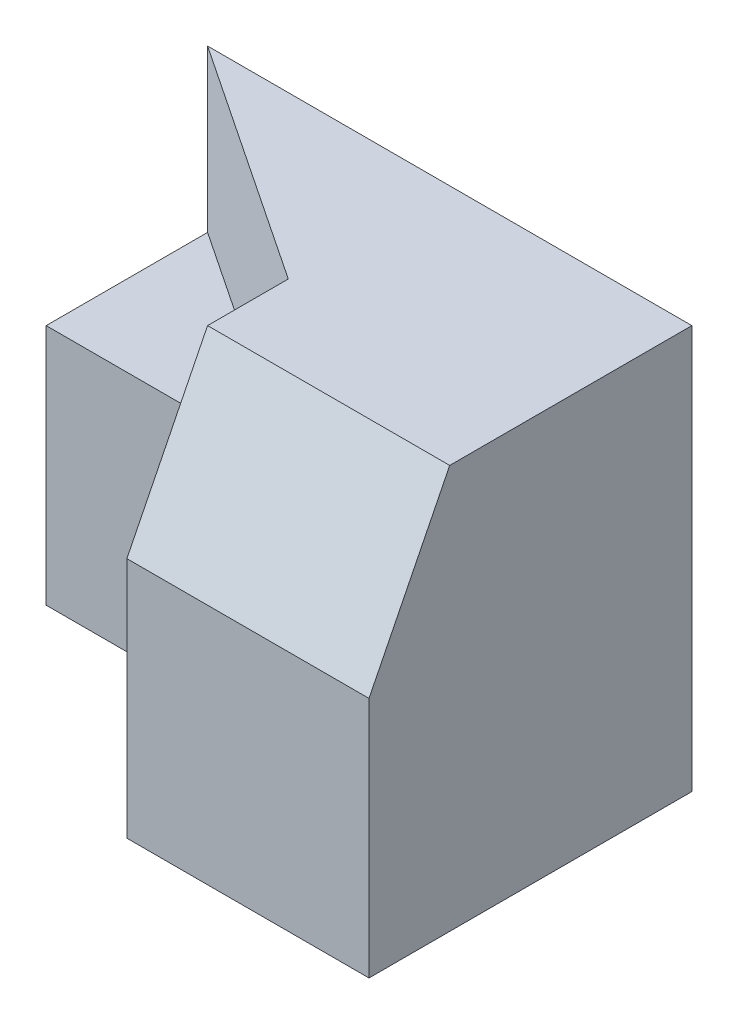
ISO-10303-21;
HEADER;
FILE_DESCRIPTION(('STEP AP214'),'2;1');
FILE_NAME('part.step','',(''),(''),'','','');
FILE_SCHEMA(('AUTOMOTIVE_DESIGN { 1 0 10303 214 1 1 1 1 }'));
ENDSEC;
DATA;
#1=APPLICATION_CONTEXT('core data for automotive mechanical design processes');
#2=APPLICATION_PROTOCOL_DEFINITION('international standard','automotive_design',2000,#1);
#3=PRODUCT_CONTEXT('',#1,'mechanical');
#4=PRODUCT('Part','Part','',(#3));
#5=PRODUCT_RELATED_PRODUCT_CATEGORY('part','',(#4));
#6=PRODUCT_DEFINITION_FORMATION('','',#4);
#7=PRODUCT_DEFINITION_CONTEXT('part definition',#1,'design');
#8=PRODUCT_DEFINITION('design','',#6,#7);
#9=PRODUCT_DEFINITION_SHAPE('','',#8);
#10=(LENGTH_UNIT() NAMED_UNIT(*) SI_UNIT(.MILLI.,.METRE.));
#11=(NAMED_UNIT(*) PLANE_ANGLE_UNIT() SI_UNIT($,.RADIAN.));
#12=(NAMED_UNIT(*) SI_UNIT($,.STERADIAN.) SOLID_ANGLE_UNIT());
#13=UNCERTAINTY_MEASURE_WITH_UNIT(LENGTH_MEASURE(1.E-05),#10,'distance_accuracy_value','');
#14=(GEOMETRIC_REPRESENTATION_CONTEXT(3) GLOBAL_UNCERTAINTY_ASSIGNED_CONTEXT((#13)) GLOBAL_UNIT_ASSIGNED_CONTEXT((#10,
#11,#12)) REPRESENTATION_CONTEXT('',''));
#15=CARTESIAN_POINT('',(0.,0.,0.));
#16=DIRECTION('',(0.,0.,1.));
#17=DIRECTION('',(1.,0.,0.));
#18=AXIS2_PLACEMENT_3D('',#15,#16,#17);
#19=CARTESIAN_POINT('',(0.,0.,20.));
#20=DIRECTION('',(1.,0.,0.));
#21=DIRECTION('',(0.,0.,-1.));
#22=AXIS2_PLACEMENT_3D('',#19,#20,#21);
#23=PLANE('',#22);
#24=DIRECTION('',(0.,-1.,0.));
#25=VECTOR('',#24,1.);
#26=CARTESIAN_POINT('',(0.,0.,10.));
#27=LINE('',#26,#25);
#28=CARTESIAN_POINT('',(0.,15.,10.));
#29=VERTEX_POINT('',#28);
#30=CARTESIAN_POINT('',(0.,0.,10.));
#31=VERTEX_POINT('',#30);
#32=EDGE_CURVE('E129',#29,#31,#27,.T.);
#33=ORIENTED_EDGE('',*,*,#32,.F.);
#34=DIRECTION('',(0.,0.,1.));
#35=VECTOR('',#34,1.);
#36=CARTESIAN_POINT('',(0.,15.,0.));
#37=LINE('',#36,#35);
#38=CARTESIAN_POINT('',(0.,15.,0.));
#39=VERTEX_POINT('',#38);
#40=EDGE_CURVE('E47',#39,#29,#37,.T.);
#41=ORIENTED_EDGE('',*,*,#40,.F.);
#42=DIRECTION('',(0.,-1.,0.));
#43=VECTOR('',#42,1.);
#44=CARTESIAN_POINT('',(0.,0.,0.));
#45=LINE('',#44,#43);
#46=CARTESIAN_POINT('',(0.,0.,0.));
#47=VERTEX_POINT('',#46);
#48=EDGE_CURVE('E136',#39,#47,#45,.T.);
#49=ORIENTED_EDGE('',*,*,#48,.T.);
#50=DIRECTION('',(0.,0.,-1.));
#51=VECTOR('',#50,1.);
#52=CARTESIAN_POINT('',(0.,0.,20.));
#53=LINE('',#52,#51);
#54=EDGE_CURVE('E11',#31,#47,#53,.T.);
#55=ORIENTED_EDGE('',*,*,#54,.F.);
#56=EDGE_LOOP('',(#33,#41,#49,#55));
#57=FACE_BOUND('',#56,.T.);
#58=ADVANCED_FACE('F33',(#57),#23,.F.);
#59=CARTESIAN_POINT('',(0.,0.,20.));
#60=DIRECTION('',(0.,1.,0.));
#61=DIRECTION('',(0.,0.,1.));
#62=AXIS2_PLACEMENT_3D('',#59,#60,#61);
#63=PLANE('',#62);
#64=DIRECTION('',(1.,0.,0.));
#65=VECTOR('',#64,1.);
#66=CARTESIAN_POINT('',(0.,0.,20.));
#67=LINE('',#66,#65);
#68=CARTESIAN_POINT('',(15.,0.,20.));
#69=VERTEX_POINT('',#68);
#70=CARTESIAN_POINT('',(30.,0.,20.));
#71=VERTEX_POINT('',#70);
#72=EDGE_CURVE('E138',#69,#71,#67,.T.);
#73=ORIENTED_EDGE('',*,*,#72,.F.);
#74=DIRECTION('',(0.,0.,1.));
#75=VECTOR('',#74,1.);
#76=CARTESIAN_POINT('',(15.,0.,10.));
#77=LINE('',#76,#75);
#78=CARTESIAN_POINT('',(15.,0.,10.));
#79=VERTEX_POINT('',#78);
#80=EDGE_CURVE('E126',#79,#69,#77,.T.);
#81=ORIENTED_EDGE('',*,*,#80,.F.);
#82=DIRECTION('',(1.,0.,0.));
#83=VECTOR('',#82,1.);
#84=CARTESIAN_POINT('',(0.,0.,10.));
#85=LINE('',#84,#83);
#86=EDGE_CURVE('E124',#31,#79,#85,.T.);
#87=ORIENTED_EDGE('',*,*,#86,.F.);
#88=ORIENTED_EDGE('',*,*,#54,.T.);
#89=DIRECTION('',(1.,0.,0.));
#90=VECTOR('',#89,1.);
#91=CARTESIAN_POINT('',(0.,0.,0.));
#92=LINE('',#91,#90);
#93=CARTESIAN_POINT('',(30.,0.,0.));
#94=VERTEX_POINT('',#93);
#95=EDGE_CURVE('E146',#47,#94,#92,.T.);
#96=ORIENTED_EDGE('',*,*,#95,.T.);
#97=DIRECTION('',(0.,0.,-1.));
#98=VECTOR('',#97,1.);
#99=CARTESIAN_POINT('',(30.,0.,20.));
#100=LINE('',#99,#98);
#101=EDGE_CURVE('E40',#71,#94,#100,.T.);
#102=ORIENTED_EDGE('',*,*,#101,.F.);
#103=EDGE_LOOP('',(#73,#81,#87,#88,#96,#102));
#104=FACE_BOUND('',#103,.T.);
#105=ADVANCED_FACE('F176',(#104),#63,.F.);
#106=CARTESIAN_POINT('',(30.,0.,20.));
#107=DIRECTION('',(-1.,0.,0.));
#108=DIRECTION('',(0.,0.,1.));
#109=AXIS2_PLACEMENT_3D('',#106,#107,#108);
#110=PLANE('',#109);
#111=DIRECTION('',(0.,0.,-1.));
#112=VECTOR('',#111,1.);
#113=CARTESIAN_POINT('',(30.,25.,20.));
#114=LINE('',#113,#112);
#115=CARTESIAN_POINT('',(30.,25.,15.));
#116=VERTEX_POINT('',#115);
#117=CARTESIAN_POINT('',(30.,25.,0.));
#118=VERTEX_POINT('',#117);
#119=EDGE_CURVE('E144',#116,#118,#114,.T.);
#120=ORIENTED_EDGE('',*,*,#119,.F.);
#121=DIRECTION('',(0.,-0.894427190999916,0.447213595499958));
#122=VECTOR('',#121,1.);
#123=CARTESIAN_POINT('',(30.,3.,26.));
#124=LINE('',#123,#122);
#125=CARTESIAN_POINT('',(30.,15.,20.));
#126=VERTEX_POINT('',#125);
#127=EDGE_CURVE('E135',#116,#126,#124,.T.);
#128=ORIENTED_EDGE('',*,*,#127,.T.);
#129=DIRECTION('',(0.,1.,0.));
#130=VECTOR('',#129,1.);
#131=CARTESIAN_POINT('',(30.,0.,20.));
#132=LINE('',#131,#130);
#133=EDGE_CURVE('E140',#71,#126,#132,.T.);
#134=ORIENTED_EDGE('',*,*,#133,.F.);
#135=ORIENTED_EDGE('',*,*,#101,.T.);
#136=DIRECTION('',(0.,1.,0.));
#137=VECTOR('',#136,1.);
#138=CARTESIAN_POINT('',(30.,0.,0.));
#139=LINE('',#138,#137);
#140=EDGE_CURVE('E148',#94,#118,#139,.T.);
#141=ORIENTED_EDGE('',*,*,#140,.T.);
#142=EDGE_LOOP('',(#120,#128,#134,#135,#141));
#143=FACE_BOUND('',#142,.T.);
#144=ADVANCED_FACE('F159',(#143),#110,.F.);
#145=CARTESIAN_POINT('',(0.,25.,20.));
#146=DIRECTION('',(0.,-1.,0.));
#147=DIRECTION('',(0.,0.,-1.));
#148=AXIS2_PLACEMENT_3D('',#145,#146,#147);
#149=PLANE('',#148);
#150=DIRECTION('',(-1.,0.,0.));
#151=VECTOR('',#150,1.);
#152=CARTESIAN_POINT('',(0.,25.,0.));
#153=LINE('',#152,#151);
#154=CARTESIAN_POINT('',(0.,25.,0.));
#155=VERTEX_POINT('',#154);
#156=EDGE_CURVE('E141',#118,#155,#153,.T.);
#157=ORIENTED_EDGE('',*,*,#156,.T.);
#158=DIRECTION('',(-0.832050294337844,0.,-0.554700196225229));
#159=VECTOR('',#158,1.);
#160=CARTESIAN_POINT('',(15.,25.,10.));
#161=LINE('',#160,#159);
#162=CARTESIAN_POINT('',(15.,25.,10.));
#163=VERTEX_POINT('',#162);
#164=EDGE_CURVE('E110',#163,#155,#161,.T.);
#165=ORIENTED_EDGE('',*,*,#164,.F.);
#166=DIRECTION('',(0.,0.,1.));
#167=VECTOR('',#166,1.);
#168=CARTESIAN_POINT('',(15.,25.,10.));
#169=LINE('',#168,#167);
#170=CARTESIAN_POINT('',(15.,25.,15.));
#171=VERTEX_POINT('',#170);
#172=EDGE_CURVE('E119',#163,#171,#169,.T.);
#173=ORIENTED_EDGE('',*,*,#172,.T.);
#174=DIRECTION('',(-1.,0.,0.));
#175=VECTOR('',#174,1.);
#176=CARTESIAN_POINT('',(35.,25.,15.));
#177=LINE('',#176,#175);
#178=EDGE_CURVE('E55',#116,#171,#177,.T.);
#179=ORIENTED_EDGE('',*,*,#178,.F.);
#180=ORIENTED_EDGE('',*,*,#119,.T.);
#181=EDGE_LOOP('',(#157,#165,#173,#179,#180));
#182=FACE_BOUND('',#181,.T.);
#183=ADVANCED_FACE('F169',(#182),#149,.F.);
#184=CARTESIAN_POINT('',(0.,0.,20.));
#185=DIRECTION('',(0.,0.,-1.));
#186=DIRECTION('',(-1.,0.,0.));
#187=AXIS2_PLACEMENT_3D('',#184,#185,#186);
#188=PLANE('',#187);
#189=ORIENTED_EDGE('',*,*,#133,.T.);
#190=DIRECTION('',(-1.,0.,0.));
#191=VECTOR('',#190,1.);
#192=CARTESIAN_POINT('',(35.,15.,20.));
#193=LINE('',#192,#191);
#194=CARTESIAN_POINT('',(15.,15.,20.));
#195=VERTEX_POINT('',#194);
#196=EDGE_CURVE('E170',#126,#195,#193,.T.);
#197=ORIENTED_EDGE('',*,*,#196,.T.);
#198=DIRECTION('',(0.,1.,0.));
#199=VECTOR('',#198,1.);
#200=CARTESIAN_POINT('',(15.,0.,20.));
#201=LINE('',#200,#199);
#202=EDGE_CURVE('E133',#69,#195,#201,.T.);
#203=ORIENTED_EDGE('',*,*,#202,.F.);
#204=ORIENTED_EDGE('',*,*,#72,.T.);
#205=EDGE_LOOP('',(#189,#197,#203,#204));
#206=FACE_BOUND('',#205,.T.);
#207=ADVANCED_FACE('F174',(#206),#188,.F.);
#208=CARTESIAN_POINT('',(0.,0.,0.));
#209=DIRECTION('',(0.,0.,-1.));
#210=DIRECTION('',(-1.,0.,0.));
#211=AXIS2_PLACEMENT_3D('',#208,#209,#210);
#212=PLANE('',#211);
#213=EDGE_CURVE('E103',#155,#39,#45,.T.);
#214=ORIENTED_EDGE('',*,*,#213,.F.);
#215=ORIENTED_EDGE('',*,*,#156,.F.);
#216=ORIENTED_EDGE('',*,*,#140,.F.);
#217=ORIENTED_EDGE('',*,*,#95,.F.);
#218=ORIENTED_EDGE('',*,*,#48,.F.);
#219=EDGE_LOOP('',(#214,#215,#216,#217,#218));
#220=FACE_BOUND('',#219,.T.);
#221=ADVANCED_FACE('F166',(#220),#212,.T.);
#222=CARTESIAN_POINT('',(15.,0.,10.));
#223=DIRECTION('',(1.,0.,0.));
#224=DIRECTION('',(0.,0.,-1.));
#225=AXIS2_PLACEMENT_3D('',#222,#223,#224);
#226=PLANE('',#225);
#227=ORIENTED_EDGE('',*,*,#202,.T.);
#228=DIRECTION('',(0.,-0.894427190999916,0.447213595499958));
#229=VECTOR('',#228,1.);
#230=CARTESIAN_POINT('',(15.,25.,15.));
#231=LINE('',#230,#229);
#232=EDGE_CURVE('E120',#171,#195,#231,.T.);
#233=ORIENTED_EDGE('',*,*,#232,.F.);
#234=ORIENTED_EDGE('',*,*,#172,.F.);
#235=DIRECTION('',(0.,1.,0.));
#236=VECTOR('',#235,1.);
#237=CARTESIAN_POINT('',(15.,15.,10.));
#238=LINE('',#237,#236);
#239=CARTESIAN_POINT('',(15.,15.,10.));
#240=VERTEX_POINT('',#239);
#241=EDGE_CURVE('E100',#240,#163,#238,.T.);
#242=ORIENTED_EDGE('',*,*,#241,.F.);
#243=DIRECTION('',(0.,1.,0.));
#244=VECTOR('',#243,1.);
#245=CARTESIAN_POINT('',(15.,0.,10.));
#246=LINE('',#245,#244);
#247=EDGE_CURVE('E116',#79,#240,#246,.T.);
#248=ORIENTED_EDGE('',*,*,#247,.F.);
#249=ORIENTED_EDGE('',*,*,#80,.T.);
#250=EDGE_LOOP('',(#227,#233,#234,#242,#248,#249));
#251=FACE_BOUND('',#250,.T.);
#252=ADVANCED_FACE('F115',(#251),#226,.F.);
#253=CARTESIAN_POINT('',(0.,0.,10.));
#254=DIRECTION('',(0.,0.,-1.));
#255=DIRECTION('',(-1.,0.,0.));
#256=AXIS2_PLACEMENT_3D('',#253,#254,#255);
#257=PLANE('',#256);
#258=ORIENTED_EDGE('',*,*,#247,.T.);
#259=DIRECTION('',(1.,0.,0.));
#260=VECTOR('',#259,1.);
#261=CARTESIAN_POINT('',(0.,15.,10.));
#262=LINE('',#261,#260);
#263=EDGE_CURVE('E104',#29,#240,#262,.T.);
#264=ORIENTED_EDGE('',*,*,#263,.F.);
#265=ORIENTED_EDGE('',*,*,#32,.T.);
#266=ORIENTED_EDGE('',*,*,#86,.T.);
#267=EDGE_LOOP('',(#258,#264,#265,#266));
#268=FACE_BOUND('',#267,.T.);
#269=ADVANCED_FACE('F122',(#268),#257,.F.);
#270=CARTESIAN_POINT('',(35.,25.,15.));
#271=DIRECTION('',(0.,-0.447213595499958,-0.894427190999916));
#272=DIRECTION('',(0.,0.894427190999916,-0.447213595499958));
#273=AXIS2_PLACEMENT_3D('',#270,#271,#272);
#274=PLANE('',#273);
#275=ORIENTED_EDGE('',*,*,#178,.T.);
#276=ORIENTED_EDGE('',*,*,#232,.T.);
#277=ORIENTED_EDGE('',*,*,#196,.F.);
#278=ORIENTED_EDGE('',*,*,#127,.F.);
#279=EDGE_LOOP('',(#275,#276,#277,#278));
#280=FACE_BOUND('',#279,.T.);
#281=ADVANCED_FACE('F203',(#280),#274,.F.);
#282=CARTESIAN_POINT('',(15.,15.,10.));
#283=DIRECTION('',(0.554700196225229,0.,-0.832050294337844));
#284=DIRECTION('',(-0.832050294337844,0.,-0.554700196225229));
#285=AXIS2_PLACEMENT_3D('',#282,#283,#284);
#286=PLANE('',#285);
#287=ORIENTED_EDGE('',*,*,#164,.T.);
#288=ORIENTED_EDGE('',*,*,#213,.T.);
#289=DIRECTION('',(-0.832050294337844,0.,-0.554700196225229));
#290=VECTOR('',#289,1.);
#291=CARTESIAN_POINT('',(15.,15.,10.));
#292=LINE('',#291,#290);
#293=EDGE_CURVE('E97',#240,#39,#292,.T.);
#294=ORIENTED_EDGE('',*,*,#293,.F.);
#295=ORIENTED_EDGE('',*,*,#241,.T.);
#296=EDGE_LOOP('',(#287,#288,#294,#295));
#297=FACE_BOUND('',#296,.T.);
#298=ADVANCED_FACE('F98',(#297),#286,.F.);
#299=CARTESIAN_POINT('',(0.,15.,0.));
#300=DIRECTION('',(0.,-1.,0.));
#301=DIRECTION('',(0.,0.,-1.));
#302=AXIS2_PLACEMENT_3D('',#299,#300,#301);
#303=PLANE('',#302);
#304=ORIENTED_EDGE('',*,*,#263,.T.);
#305=ORIENTED_EDGE('',*,*,#293,.T.);
#306=ORIENTED_EDGE('',*,*,#40,.T.);
#307=EDGE_LOOP('',(#304,#305,#306));
#308=FACE_BOUND('',#307,.T.);
#309=ADVANCED_FACE('F106',(#308),#303,.F.);
#310=CLOSED_SHELL('',(#58,#105,#144,#183,#207,#221,#252,#269,#281,#298,#309));
#311=MANIFOLD_SOLID_BREP('B2',#310);
#312=ADVANCED_BREP_SHAPE_REPRESENTATION('',(#18,#311),#14);
#313=SHAPE_DEFINITION_REPRESENTATION(#9,#312);
ENDSEC;
END-ISO-10303-21;
